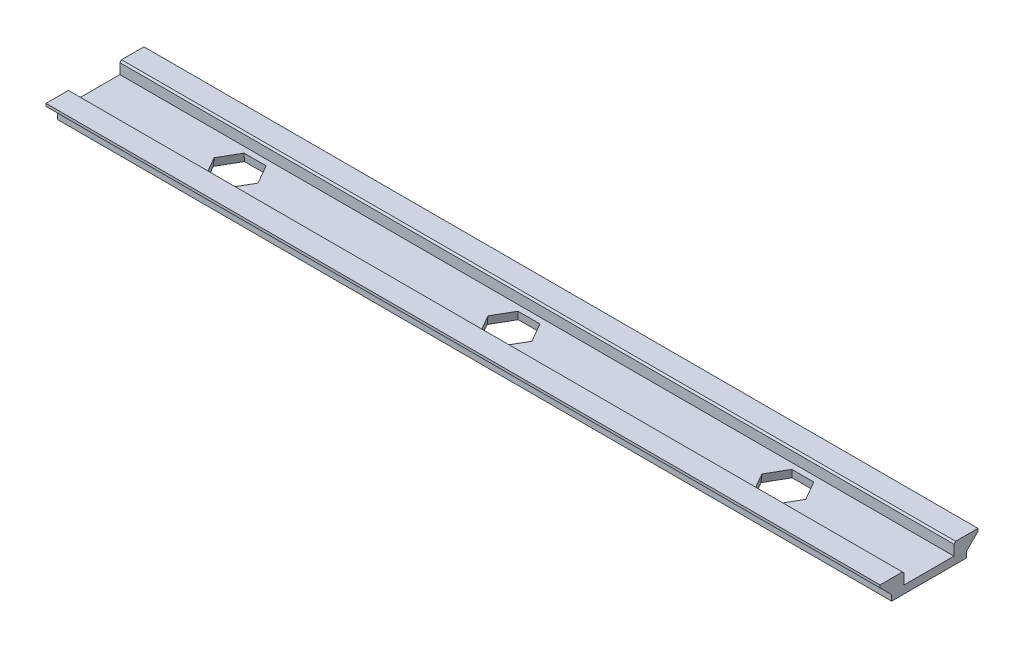
ISO-10303-21;
HEADER;
FILE_DESCRIPTION(('STEP AP214'),'2;1');
FILE_NAME('part.step','',(''),(''),'','','');
FILE_SCHEMA(('AUTOMOTIVE_DESIGN { 1 0 10303 214 1 1 1 1 }'));
ENDSEC;
DATA;
#1=APPLICATION_CONTEXT('core data for automotive mechanical design processes');
#2=APPLICATION_PROTOCOL_DEFINITION('international standard','automotive_design',2000,#1);
#3=PRODUCT_CONTEXT('',#1,'mechanical');
#4=PRODUCT('Part','Part','',(#3));
#5=PRODUCT_RELATED_PRODUCT_CATEGORY('part','',(#4));
#6=PRODUCT_DEFINITION_FORMATION('','',#4);
#7=PRODUCT_DEFINITION_CONTEXT('part definition',#1,'design');
#8=PRODUCT_DEFINITION('design','',#6,#7);
#9=PRODUCT_DEFINITION_SHAPE('','',#8);
#10=(LENGTH_UNIT() NAMED_UNIT(*) SI_UNIT(.MILLI.,.METRE.));
#11=(NAMED_UNIT(*) PLANE_ANGLE_UNIT() SI_UNIT($,.RADIAN.));
#12=(NAMED_UNIT(*) SI_UNIT($,.STERADIAN.) SOLID_ANGLE_UNIT());
#13=UNCERTAINTY_MEASURE_WITH_UNIT(LENGTH_MEASURE(1.E-05),#10,'distance_accuracy_value','');
#14=(GEOMETRIC_REPRESENTATION_CONTEXT(3) GLOBAL_UNCERTAINTY_ASSIGNED_CONTEXT((#13)) GLOBAL_UNIT_ASSIGNED_CONTEXT((#10,
#11,#12)) REPRESENTATION_CONTEXT('',''));
#15=CARTESIAN_POINT('',(0.,0.,0.));
#16=DIRECTION('',(0.,0.,1.));
#17=DIRECTION('',(1.,0.,0.));
#18=AXIS2_PLACEMENT_3D('',#15,#16,#17);
#19=CARTESIAN_POINT('',(50.25,4.59230484541326,5.1));
#20=DIRECTION('',(0.,-1.,0.));
#21=DIRECTION('',(0.,0.,-1.));
#22=AXIS2_PLACEMENT_3D('',#19,#20,#21);
#23=PLANE('',#22);
#24=DIRECTION('',(0.,0.,1.));
#25=VECTOR('',#24,1.);
#26=CARTESIAN_POINT('',(50.25,4.59230484541326,5.1));
#27=LINE('',#26,#25);
#28=CARTESIAN_POINT('',(50.25,4.59230484541326,3.19999999999999));
#29=VERTEX_POINT('',#28);
#30=CARTESIAN_POINT('',(50.25,4.59230484541326,5.9));
#31=VERTEX_POINT('',#30);
#32=EDGE_CURVE('E356',#29,#31,#27,.T.);
#33=ORIENTED_EDGE('',*,*,#32,.F.);
#34=DIRECTION('',(-1.,0.,0.));
#35=VECTOR('',#34,1.);
#36=CARTESIAN_POINT('',(50.25,4.59230484541326,3.19999999999999));
#37=LINE('',#36,#35);
#38=CARTESIAN_POINT('',(-50.25,4.59230484541326,3.19999999999999));
#39=VERTEX_POINT('',#38);
#40=EDGE_CURVE('E487',#29,#39,#37,.T.);
#41=ORIENTED_EDGE('',*,*,#40,.T.);
#42=DIRECTION('',(0.,0.,1.));
#43=VECTOR('',#42,1.);
#44=CARTESIAN_POINT('',(-50.25,4.59230484541326,5.1));
#45=LINE('',#44,#43);
#46=CARTESIAN_POINT('',(-50.25,4.59230484541326,5.9));
#47=VERTEX_POINT('',#46);
#48=EDGE_CURVE('E257',#39,#47,#45,.T.);
#49=ORIENTED_EDGE('',*,*,#48,.T.);
#50=DIRECTION('',(-1.,0.,0.));
#51=VECTOR('',#50,1.);
#52=CARTESIAN_POINT('',(50.25,4.59230484541326,5.9));
#53=LINE('',#52,#51);
#54=EDGE_CURVE('E433',#31,#47,#53,.T.);
#55=ORIENTED_EDGE('',*,*,#54,.F.);
#56=EDGE_LOOP('',(#33,#41,#49,#55));
#57=FACE_BOUND('',#56,.T.);
#58=ADVANCED_FACE('F35',(#57),#23,.F.);
#59=CARTESIAN_POINT('',(50.25,4.59230484541326,5.9));
#60=DIRECTION('',(0.,0.,-1.));
#61=DIRECTION('',(-1.,0.,0.));
#62=AXIS2_PLACEMENT_3D('',#59,#60,#61);
#63=PLANE('',#62);
#64=DIRECTION('',(0.,-1.,0.));
#65=VECTOR('',#64,1.);
#66=CARTESIAN_POINT('',(-50.25,4.59230484541326,5.9));
#67=LINE('',#66,#65);
#68=CARTESIAN_POINT('',(-50.25,4.27514755788788,5.9));
#69=VERTEX_POINT('',#68);
#70=EDGE_CURVE('E384',#47,#69,#67,.T.);
#71=ORIENTED_EDGE('',*,*,#70,.T.);
#72=DIRECTION('',(-1.,0.,0.));
#73=VECTOR('',#72,1.);
#74=CARTESIAN_POINT('',(50.25,4.27514755788788,5.9));
#75=LINE('',#74,#73);
#76=CARTESIAN_POINT('',(50.25,4.27514755788788,5.9));
#77=VERTEX_POINT('',#76);
#78=EDGE_CURVE('E430',#77,#69,#75,.T.);
#79=ORIENTED_EDGE('',*,*,#78,.F.);
#80=DIRECTION('',(0.,-1.,0.));
#81=VECTOR('',#80,1.);
#82=CARTESIAN_POINT('',(50.25,4.59230484541326,5.9));
#83=LINE('',#82,#81);
#84=EDGE_CURVE('E358',#31,#77,#83,.T.);
#85=ORIENTED_EDGE('',*,*,#84,.F.);
#86=ORIENTED_EDGE('',*,*,#54,.T.);
#87=EDGE_LOOP('',(#71,#79,#85,#86));
#88=FACE_BOUND('',#87,.T.);
#89=ADVANCED_FACE('F531',(#88),#63,.F.);
#90=CARTESIAN_POINT('',(50.25,4.27514755788788,5.9));
#91=DIRECTION('',(0.,0.707106781186549,-0.707106781186546));
#92=DIRECTION('',(0.,0.707106781186546,0.707106781186549));
#93=AXIS2_PLACEMENT_3D('',#90,#91,#92);
#94=PLANE('',#93);
#95=DIRECTION('',(0.,-0.707106781186546,-0.707106781186549));
#96=VECTOR('',#95,1.);
#97=CARTESIAN_POINT('',(-50.25,4.27514755788788,5.9));
#98=LINE('',#97,#96);
#99=CARTESIAN_POINT('',(-50.25,2.87514755788788,4.49999999999999));
#100=VERTEX_POINT('',#99);
#101=EDGE_CURVE('E386',#69,#100,#98,.T.);
#102=ORIENTED_EDGE('',*,*,#101,.T.);
#103=DIRECTION('',(-1.,0.,0.));
#104=VECTOR('',#103,1.);
#105=CARTESIAN_POINT('',(50.25,2.87514755788788,4.49999999999999));
#106=LINE('',#105,#104);
#107=CARTESIAN_POINT('',(50.25,2.87514755788788,4.49999999999999));
#108=VERTEX_POINT('',#107);
#109=EDGE_CURVE('E427',#108,#100,#106,.T.);
#110=ORIENTED_EDGE('',*,*,#109,.F.);
#111=DIRECTION('',(0.,-0.707106781186546,-0.707106781186549));
#112=VECTOR('',#111,1.);
#113=CARTESIAN_POINT('',(50.25,4.27514755788788,5.9));
#114=LINE('',#113,#112);
#115=EDGE_CURVE('E361',#77,#108,#114,.T.);
#116=ORIENTED_EDGE('',*,*,#115,.F.);
#117=ORIENTED_EDGE('',*,*,#78,.T.);
#118=EDGE_LOOP('',(#102,#110,#116,#117));
#119=FACE_BOUND('',#118,.T.);
#120=ADVANCED_FACE('F535',(#119),#94,.F.);
#121=CARTESIAN_POINT('',(50.25,2.87514755788788,4.49999999999999));
#122=DIRECTION('',(0.,0.,-1.));
#123=DIRECTION('',(-1.,0.,0.));
#124=AXIS2_PLACEMENT_3D('',#121,#122,#123);
#125=PLANE('',#124);
#126=DIRECTION('',(0.,-1.,0.));
#127=VECTOR('',#126,1.);
#128=CARTESIAN_POINT('',(-50.25,2.87514755788788,4.49999999999999));
#129=LINE('',#128,#127);
#130=CARTESIAN_POINT('',(-50.25,2.19230484541326,4.49999999999999));
#131=VERTEX_POINT('',#130);
#132=EDGE_CURVE('E388',#100,#131,#129,.T.);
#133=ORIENTED_EDGE('',*,*,#132,.T.);
#134=DIRECTION('',(-1.,0.,0.));
#135=VECTOR('',#134,1.);
#136=CARTESIAN_POINT('',(50.25,2.19230484541326,4.49999999999999));
#137=LINE('',#136,#135);
#138=CARTESIAN_POINT('',(50.25,2.19230484541326,4.49999999999999));
#139=VERTEX_POINT('',#138);
#140=EDGE_CURVE('E424',#139,#131,#137,.T.);
#141=ORIENTED_EDGE('',*,*,#140,.F.);
#142=DIRECTION('',(0.,-1.,0.));
#143=VECTOR('',#142,1.);
#144=CARTESIAN_POINT('',(50.25,2.87514755788788,4.49999999999999));
#145=LINE('',#144,#143);
#146=EDGE_CURVE('E363',#108,#139,#145,.T.);
#147=ORIENTED_EDGE('',*,*,#146,.F.);
#148=ORIENTED_EDGE('',*,*,#109,.T.);
#149=EDGE_LOOP('',(#133,#141,#147,#148));
#150=FACE_BOUND('',#149,.T.);
#151=ADVANCED_FACE('F542',(#150),#125,.F.);
#152=CARTESIAN_POINT('',(50.25,2.19230484541326,4.49999999999999));
#153=DIRECTION('',(0.,1.,0.));
#154=DIRECTION('',(0.,0.,1.));
#155=AXIS2_PLACEMENT_3D('',#152,#153,#154);
#156=PLANE('',#155);
#157=DIRECTION('',(1.,0.,0.));
#158=VECTOR('',#157,1.);
#159=CARTESIAN_POINT('',(0.,2.19230484541326,2.37503630192332));
#160=LINE('',#159,#158);
#161=CARTESIAN_POINT('',(31.3787721517494,2.19230484541326,2.37503630192331));
#162=VERTEX_POINT('',#161);
#163=CARTESIAN_POINT('',(34.1212278482506,2.19230484541326,2.37503630192331));
#164=VERTEX_POINT('',#163);
#165=EDGE_CURVE('E250',#162,#164,#160,.T.);
#166=ORIENTED_EDGE('',*,*,#165,.T.);
#167=DIRECTION('',(0.500000000000002,0.,-0.866025403784438));
#168=VECTOR('',#167,1.);
#169=CARTESIAN_POINT('',(26.6193417723758,2.19230484541326,15.3686841379319));
#170=LINE('',#169,#168);
#171=CARTESIAN_POINT('',(35.4924556965011,2.19230484541326,0.));
#172=VERTEX_POINT('',#171);
#173=EDGE_CURVE('E261',#164,#172,#170,.T.);
#174=ORIENTED_EDGE('',*,*,#173,.T.);
#175=DIRECTION('',(-0.500000000000001,0.,-0.866025403784438));
#176=VECTOR('',#175,1.);
#177=CARTESIAN_POINT('',(26.6193417723758,2.19230484541326,-15.3686841379319));
#178=LINE('',#177,#176);
#179=CARTESIAN_POINT('',(34.1212278482506,2.19230484541326,-2.37503630192331));
#180=VERTEX_POINT('',#179);
#181=EDGE_CURVE('E267',#172,#180,#178,.T.);
#182=ORIENTED_EDGE('',*,*,#181,.T.);
#183=DIRECTION('',(-1.,0.,0.));
#184=VECTOR('',#183,1.);
#185=CARTESIAN_POINT('',(0.,2.19230484541326,-2.3750363019233));
#186=LINE('',#185,#184);
#187=CARTESIAN_POINT('',(31.3787721517494,2.19230484541326,-2.37503630192331));
#188=VERTEX_POINT('',#187);
#189=EDGE_CURVE('E283',#180,#188,#186,.T.);
#190=ORIENTED_EDGE('',*,*,#189,.T.);
#191=DIRECTION('',(-0.5,0.,0.866025403784439));
#192=VECTOR('',#191,1.);
#193=CARTESIAN_POINT('',(22.5056582276242,2.19230484541326,12.9936478360085));
#194=LINE('',#193,#192);
#195=CARTESIAN_POINT('',(30.0075443034989,2.19230484541326,0.));
#196=VERTEX_POINT('',#195);
#197=EDGE_CURVE('E278',#188,#196,#194,.T.);
#198=ORIENTED_EDGE('',*,*,#197,.T.);
#199=DIRECTION('',(0.5,0.,0.866025403784439));
#200=VECTOR('',#199,1.);
#201=CARTESIAN_POINT('',(22.5056582276242,2.19230484541326,-12.9936478360085));
#202=LINE('',#201,#200);
#203=EDGE_CURVE('E274',#196,#162,#202,.T.);
#204=ORIENTED_EDGE('',*,*,#203,.T.);
#205=EDGE_LOOP('',(#166,#174,#182,#190,#198,#204));
#206=FACE_BOUND('',#205,.T.);
#207=DIRECTION('',(1.,0.,0.));
#208=VECTOR('',#207,1.);
#209=CARTESIAN_POINT('',(0.,2.19230484541326,2.37503630192354));
#210=LINE('',#209,#208);
#211=CARTESIAN_POINT('',(-1.62122784825056,2.19230484541326,2.37503630192354));
#212=VERTEX_POINT('',#211);
#213=CARTESIAN_POINT('',(1.12122784825056,2.19230484541326,2.37503630192354));
#214=VERTEX_POINT('',#213);
#215=EDGE_CURVE('E293',#212,#214,#210,.T.);
#216=ORIENTED_EDGE('',*,*,#215,.T.);
#217=DIRECTION('',(0.500000000000002,0.,-0.866025403784438));
#218=VECTOR('',#217,1.);
#219=CARTESIAN_POINT('',(1.86934177237594,2.19230484541326,1.07926497548866));
#220=LINE('',#219,#218);
#221=CARTESIAN_POINT('',(2.49245569650112,2.19230484541326,2.36030449715472E-13));
#222=VERTEX_POINT('',#221);
#223=EDGE_CURVE('E304',#214,#222,#220,.T.);
#224=ORIENTED_EDGE('',*,*,#223,.T.);
#225=DIRECTION('',(-0.500000000000001,0.,-0.866025403784438));
#226=VECTOR('',#225,1.);
#227=CARTESIAN_POINT('',(1.86934177237574,2.19230484541326,-1.07926497548854));
#228=LINE('',#227,#226);
#229=CARTESIAN_POINT('',(1.12122784825056,2.19230484541326,-2.37503630192307));
#230=VERTEX_POINT('',#229);
#231=EDGE_CURVE('E307',#222,#230,#228,.T.);
#232=ORIENTED_EDGE('',*,*,#231,.T.);
#233=DIRECTION('',(-1.,0.,0.));
#234=VECTOR('',#233,1.);
#235=CARTESIAN_POINT('',(0.,2.19230484541326,-2.37503630192308));
#236=LINE('',#235,#234);
#237=CARTESIAN_POINT('',(-1.62122784825055,2.19230484541326,-2.37503630192308));
#238=VERTEX_POINT('',#237);
#239=EDGE_CURVE('E317',#230,#238,#236,.T.);
#240=ORIENTED_EDGE('',*,*,#239,.T.);
#241=DIRECTION('',(-0.5,0.,0.866025403784439));
#242=VECTOR('',#241,1.);
#243=CARTESIAN_POINT('',(-2.24434177237573,2.19230484541326,-1.29577132643465));
#244=LINE('',#243,#242);
#245=CARTESIAN_POINT('',(-2.99245569650111,2.19230484541326,2.39704417029874E-13));
#246=VERTEX_POINT('',#245);
#247=EDGE_CURVE('E314',#238,#246,#244,.T.);
#248=ORIENTED_EDGE('',*,*,#247,.T.);
#249=DIRECTION('',(0.5,0.,0.866025403784439));
#250=VECTOR('',#249,1.);
#251=CARTESIAN_POINT('',(-2.24434177237594,2.19230484541326,1.29577132643477));
#252=LINE('',#251,#250);
#253=EDGE_CURVE('E311',#246,#212,#252,.T.);
#254=ORIENTED_EDGE('',*,*,#253,.T.);
#255=EDGE_LOOP('',(#216,#224,#232,#240,#248,#254));
#256=FACE_BOUND('',#255,.T.);
#257=DIRECTION('',(1.,0.,0.));
#258=VECTOR('',#257,1.);
#259=CARTESIAN_POINT('',(0.,2.19230484541326,2.37503630192377));
#260=LINE('',#259,#258);
#261=CARTESIAN_POINT('',(-34.6212278482506,2.19230484541326,2.37503630192377));
#262=VERTEX_POINT('',#261);
#263=CARTESIAN_POINT('',(-31.8787721517494,2.19230484541326,2.37503630192377));
#264=VERTEX_POINT('',#263);
#265=EDGE_CURVE('E328',#262,#264,#260,.T.);
#266=ORIENTED_EDGE('',*,*,#265,.T.);
#267=DIRECTION('',(0.500000000000002,0.,-0.866025403784438));
#268=VECTOR('',#267,1.);
#269=CARTESIAN_POINT('',(-22.8806582276239,2.19230484541326,-13.2101541869545));
#270=LINE('',#269,#268);
#271=CARTESIAN_POINT('',(-30.5075443034989,2.19230484541326,4.66425240595042E-13));
#272=VERTEX_POINT('',#271);
#273=EDGE_CURVE('E339',#264,#272,#270,.T.);
#274=ORIENTED_EDGE('',*,*,#273,.T.);
#275=DIRECTION('',(-0.500000000000001,0.,-0.866025403784438));
#276=VECTOR('',#275,1.);
#277=CARTESIAN_POINT('',(-22.8806582276243,2.19230484541326,13.2101541869548));
#278=LINE('',#277,#276);
#279=CARTESIAN_POINT('',(-31.8787721517494,2.19230484541326,-2.37503630192284));
#280=VERTEX_POINT('',#279);
#281=EDGE_CURVE('E342',#272,#280,#278,.T.);
#282=ORIENTED_EDGE('',*,*,#281,.T.);
#283=DIRECTION('',(-1.,0.,0.));
#284=VECTOR('',#283,1.);
#285=CARTESIAN_POINT('',(0.,2.19230484541326,-2.37503630192285));
#286=LINE('',#285,#284);
#287=CARTESIAN_POINT('',(-34.6212278482506,2.19230484541326,-2.37503630192285));
#288=VERTEX_POINT('',#287);
#289=EDGE_CURVE('E351',#280,#288,#286,.T.);
#290=ORIENTED_EDGE('',*,*,#289,.T.);
#291=DIRECTION('',(-0.5,0.,0.866025403784439));
#292=VECTOR('',#291,1.);
#293=CARTESIAN_POINT('',(-26.9943417723756,2.19230484541326,-15.5851904888778));
#294=LINE('',#293,#292);
#295=CARTESIAN_POINT('',(-35.9924556965011,2.19230484541326,4.70251019758386E-13));
#296=VERTEX_POINT('',#295);
#297=EDGE_CURVE('E348',#288,#296,#294,.T.);
#298=ORIENTED_EDGE('',*,*,#297,.T.);
#299=DIRECTION('',(0.5,0.,0.866025403784439));
#300=VECTOR('',#299,1.);
#301=CARTESIAN_POINT('',(-26.994341772376,2.19230484541326,15.5851904888781));
#302=LINE('',#301,#300);
#303=EDGE_CURVE('E345',#296,#262,#302,.T.);
#304=ORIENTED_EDGE('',*,*,#303,.T.);
#305=EDGE_LOOP('',(#266,#274,#282,#290,#298,#304));
#306=FACE_BOUND('',#305,.T.);
#307=DIRECTION('',(0.,0.,-1.));
#308=VECTOR('',#307,1.);
#309=CARTESIAN_POINT('',(-50.25,2.19230484541326,4.49999999999999));
#310=LINE('',#309,#308);
#311=CARTESIAN_POINT('',(-50.25,2.19230484541326,-4.49999999999999));
#312=VERTEX_POINT('',#311);
#313=EDGE_CURVE('E390',#131,#312,#310,.T.);
#314=ORIENTED_EDGE('',*,*,#313,.T.);
#315=DIRECTION('',(-1.,0.,0.));
#316=VECTOR('',#315,1.);
#317=CARTESIAN_POINT('',(50.25,2.19230484541326,-4.49999999999999));
#318=LINE('',#317,#316);
#319=CARTESIAN_POINT('',(50.25,2.19230484541326,-4.49999999999999));
#320=VERTEX_POINT('',#319);
#321=EDGE_CURVE('E421',#320,#312,#318,.T.);
#322=ORIENTED_EDGE('',*,*,#321,.F.);
#323=DIRECTION('',(0.,0.,-1.));
#324=VECTOR('',#323,1.);
#325=CARTESIAN_POINT('',(50.25,2.19230484541326,4.49999999999999));
#326=LINE('',#325,#324);
#327=EDGE_CURVE('E365',#139,#320,#326,.T.);
#328=ORIENTED_EDGE('',*,*,#327,.F.);
#329=ORIENTED_EDGE('',*,*,#140,.T.);
#330=EDGE_LOOP('',(#314,#322,#328,#329));
#331=FACE_BOUND('',#330,.T.);
#332=ADVANCED_FACE('F270',(#206,#256,#306,#331),#156,.F.);
#333=CARTESIAN_POINT('',(50.25,2.87514755788788,-4.49999999999999));
#334=DIRECTION('',(0.,0.,1.));
#335=DIRECTION('',(0.,-1.,0.));
#336=AXIS2_PLACEMENT_3D('',#333,#334,#335);
#337=PLANE('',#336);
#338=DIRECTION('',(0.,1.,0.));
#339=VECTOR('',#338,1.);
#340=CARTESIAN_POINT('',(-50.25,2.87514755788788,-4.49999999999999));
#341=LINE('',#340,#339);
#342=CARTESIAN_POINT('',(-50.25,2.87514755788788,-4.49999999999999));
#343=VERTEX_POINT('',#342);
#344=EDGE_CURVE('E392',#312,#343,#341,.T.);
#345=ORIENTED_EDGE('',*,*,#344,.T.);
#346=DIRECTION('',(-1.,0.,0.));
#347=VECTOR('',#346,1.);
#348=CARTESIAN_POINT('',(50.25,2.87514755788788,-4.49999999999999));
#349=LINE('',#348,#347);
#350=CARTESIAN_POINT('',(50.25,2.87514755788788,-4.49999999999999));
#351=VERTEX_POINT('',#350);
#352=EDGE_CURVE('E418',#351,#343,#349,.T.);
#353=ORIENTED_EDGE('',*,*,#352,.F.);
#354=DIRECTION('',(0.,1.,0.));
#355=VECTOR('',#354,1.);
#356=CARTESIAN_POINT('',(50.25,2.87514755788788,-4.49999999999999));
#357=LINE('',#356,#355);
#358=EDGE_CURVE('E367',#320,#351,#357,.T.);
#359=ORIENTED_EDGE('',*,*,#358,.F.);
#360=ORIENTED_EDGE('',*,*,#321,.T.);
#361=EDGE_LOOP('',(#345,#353,#359,#360));
#362=FACE_BOUND('',#361,.T.);
#363=ADVANCED_FACE('F549',(#362),#337,.F.);
#364=CARTESIAN_POINT('',(50.25,4.27514755788788,-5.9));
#365=DIRECTION('',(0.,0.707106781186549,0.707106781186546));
#366=DIRECTION('',(0.,-0.707106781186546,0.707106781186549));
#367=AXIS2_PLACEMENT_3D('',#364,#365,#366);
#368=PLANE('',#367);
#369=DIRECTION('',(0.,0.707106781186546,-0.707106781186549));
#370=VECTOR('',#369,1.);
#371=CARTESIAN_POINT('',(-50.25,4.27514755788788,-5.9));
#372=LINE('',#371,#370);
#373=CARTESIAN_POINT('',(-50.25,4.27514755788788,-5.9));
#374=VERTEX_POINT('',#373);
#375=EDGE_CURVE('E394',#343,#374,#372,.T.);
#376=ORIENTED_EDGE('',*,*,#375,.T.);
#377=DIRECTION('',(-1.,0.,0.));
#378=VECTOR('',#377,1.);
#379=CARTESIAN_POINT('',(50.25,4.27514755788788,-5.9));
#380=LINE('',#379,#378);
#381=CARTESIAN_POINT('',(50.25,4.27514755788788,-5.9));
#382=VERTEX_POINT('',#381);
#383=EDGE_CURVE('E415',#382,#374,#380,.T.);
#384=ORIENTED_EDGE('',*,*,#383,.F.);
#385=DIRECTION('',(0.,0.707106781186546,-0.707106781186549));
#386=VECTOR('',#385,1.);
#387=CARTESIAN_POINT('',(50.25,4.27514755788788,-5.9));
#388=LINE('',#387,#386);
#389=EDGE_CURVE('E369',#351,#382,#388,.T.);
#390=ORIENTED_EDGE('',*,*,#389,.F.);
#391=ORIENTED_EDGE('',*,*,#352,.T.);
#392=EDGE_LOOP('',(#376,#384,#390,#391));
#393=FACE_BOUND('',#392,.T.);
#394=ADVANCED_FACE('F555',(#393),#368,.F.);
#395=CARTESIAN_POINT('',(50.25,4.59230484541326,-5.9));
#396=DIRECTION('',(0.,0.,1.));
#397=DIRECTION('',(1.,0.,0.));
#398=AXIS2_PLACEMENT_3D('',#395,#396,#397);
#399=PLANE('',#398);
#400=DIRECTION('',(0.,1.,0.));
#401=VECTOR('',#400,1.);
#402=CARTESIAN_POINT('',(-50.25,4.59230484541326,-5.9));
#403=LINE('',#402,#401);
#404=CARTESIAN_POINT('',(-50.25,4.59230484541326,-5.9));
#405=VERTEX_POINT('',#404);
#406=EDGE_CURVE('E396',#374,#405,#403,.T.);
#407=ORIENTED_EDGE('',*,*,#406,.T.);
#408=DIRECTION('',(-1.,0.,0.));
#409=VECTOR('',#408,1.);
#410=CARTESIAN_POINT('',(50.25,4.59230484541326,-5.9));
#411=LINE('',#410,#409);
#412=CARTESIAN_POINT('',(50.25,4.59230484541326,-5.9));
#413=VERTEX_POINT('',#412);
#414=EDGE_CURVE('E412',#413,#405,#411,.T.);
#415=ORIENTED_EDGE('',*,*,#414,.F.);
#416=DIRECTION('',(0.,1.,0.));
#417=VECTOR('',#416,1.);
#418=CARTESIAN_POINT('',(50.25,4.59230484541326,-5.9));
#419=LINE('',#418,#417);
#420=EDGE_CURVE('E371',#382,#413,#419,.T.);
#421=ORIENTED_EDGE('',*,*,#420,.F.);
#422=ORIENTED_EDGE('',*,*,#383,.T.);
#423=EDGE_LOOP('',(#407,#415,#421,#422));
#424=FACE_BOUND('',#423,.T.);
#425=ADVANCED_FACE('F559',(#424),#399,.F.);
#426=CARTESIAN_POINT('',(50.25,4.59230484541326,-5.1));
#427=DIRECTION('',(0.,-1.,0.));
#428=DIRECTION('',(0.,0.,-1.));
#429=AXIS2_PLACEMENT_3D('',#426,#427,#428);
#430=PLANE('',#429);
#431=DIRECTION('',(0.,0.,1.));
#432=VECTOR('',#431,1.);
#433=CARTESIAN_POINT('',(-50.25,4.59230484541326,-5.1));
#434=LINE('',#433,#432);
#435=CARTESIAN_POINT('',(-50.25,4.59230484541326,-3.19999999999999));
#436=VERTEX_POINT('',#435);
#437=EDGE_CURVE('E399',#405,#436,#434,.T.);
#438=ORIENTED_EDGE('',*,*,#437,.T.);
#439=DIRECTION('',(1.,0.,0.));
#440=VECTOR('',#439,1.);
#441=CARTESIAN_POINT('',(50.25,4.59230484541326,-3.19999999999999));
#442=LINE('',#441,#440);
#443=CARTESIAN_POINT('',(50.25,4.59230484541327,-3.19999999999999));
#444=VERTEX_POINT('',#443);
#445=EDGE_CURVE('E11',#436,#444,#442,.T.);
#446=ORIENTED_EDGE('',*,*,#445,.T.);
#447=DIRECTION('',(0.,0.,1.));
#448=VECTOR('',#447,1.);
#449=CARTESIAN_POINT('',(50.25,4.59230484541326,-5.1));
#450=LINE('',#449,#448);
#451=EDGE_CURVE('E373',#413,#444,#450,.T.);
#452=ORIENTED_EDGE('',*,*,#451,.F.);
#453=ORIENTED_EDGE('',*,*,#414,.T.);
#454=EDGE_LOOP('',(#438,#446,#452,#453));
#455=FACE_BOUND('',#454,.T.);
#456=ADVANCED_FACE('F560',(#455),#430,.F.);
#457=CARTESIAN_POINT('',(50.25,4.59230484541326,-3.));
#458=DIRECTION('',(0.,0.,-1.));
#459=DIRECTION('',(-1.,0.,0.));
#460=AXIS2_PLACEMENT_3D('',#457,#458,#459);
#461=PLANE('',#460);
#462=DIRECTION('',(0.,-1.,0.));
#463=VECTOR('',#462,1.);
#464=CARTESIAN_POINT('',(50.25,4.59230484541326,-3.));
#465=LINE('',#464,#463);
#466=CARTESIAN_POINT('',(50.25,4.39230484541327,-3.));
#467=VERTEX_POINT('',#466);
#468=CARTESIAN_POINT('',(50.25,3.14230484541326,-3.));
#469=VERTEX_POINT('',#468);
#470=EDGE_CURVE('E375',#467,#469,#465,.T.);
#471=ORIENTED_EDGE('',*,*,#470,.F.);
#472=DIRECTION('',(-1.,0.,0.));
#473=VECTOR('',#472,1.);
#474=CARTESIAN_POINT('',(50.25,4.39230484541327,-3.));
#475=LINE('',#474,#473);
#476=CARTESIAN_POINT('',(-50.25,4.39230484541327,-3.));
#477=VERTEX_POINT('',#476);
#478=EDGE_CURVE('E44',#467,#477,#475,.T.);
#479=ORIENTED_EDGE('',*,*,#478,.T.);
#480=DIRECTION('',(0.,-1.,0.));
#481=VECTOR('',#480,1.);
#482=CARTESIAN_POINT('',(-50.25,4.59230484541326,-3.));
#483=LINE('',#482,#481);
#484=CARTESIAN_POINT('',(-50.25,3.14230484541326,-3.));
#485=VERTEX_POINT('',#484);
#486=EDGE_CURVE('E401',#477,#485,#483,.T.);
#487=ORIENTED_EDGE('',*,*,#486,.T.);
#488=DIRECTION('',(-1.,0.,0.));
#489=VECTOR('',#488,1.);
#490=CARTESIAN_POINT('',(50.25,3.14230484541326,-3.));
#491=LINE('',#490,#489);
#492=EDGE_CURVE('E409',#469,#485,#491,.T.);
#493=ORIENTED_EDGE('',*,*,#492,.F.);
#494=EDGE_LOOP('',(#471,#479,#487,#493));
#495=FACE_BOUND('',#494,.T.);
#496=ADVANCED_FACE('F502',(#495),#461,.F.);
#497=CARTESIAN_POINT('',(50.25,3.14230484541326,3.));
#498=DIRECTION('',(0.,-1.,0.));
#499=DIRECTION('',(0.,0.,-1.));
#500=AXIS2_PLACEMENT_3D('',#497,#498,#499);
#501=PLANE('',#500);
#502=DIRECTION('',(0.500000000000001,0.,0.866025403784438));
#503=VECTOR('',#502,1.);
#504=CARTESIAN_POINT('',(40.4089008431537,3.14230484541326,8.681761247327));
#505=LINE('',#504,#503);
#506=CARTESIAN_POINT('',(34.0732418249847,3.14230484541326,-2.29192207157368));
#507=VERTEX_POINT('',#506);
#508=CARTESIAN_POINT('',(35.3964836499694,3.14230484541326,0.));
#509=VERTEX_POINT('',#508);
#510=EDGE_CURVE('E472',#507,#509,#505,.T.);
#511=ORIENTED_EDGE('',*,*,#510,.T.);
#512=DIRECTION('',(-0.500000000000002,0.,0.866025403784438));
#513=VECTOR('',#512,1.);
#514=CARTESIAN_POINT('',(37.8108246318004,3.14230484541326,-4.18176124732701));
#515=LINE('',#514,#513);
#516=CARTESIAN_POINT('',(34.0732418249847,3.14230484541326,2.29192207157368));
#517=VERTEX_POINT('',#516);
#518=EDGE_CURVE('E485',#509,#517,#515,.T.);
#519=ORIENTED_EDGE('',*,*,#518,.T.);
#520=DIRECTION('',(-1.,0.,0.));
#521=VECTOR('',#520,1.);
#522=CARTESIAN_POINT('',(50.25,3.14230484541326,2.29192207157368));
#523=LINE('',#522,#521);
#524=CARTESIAN_POINT('',(31.4267581750153,3.14230484541326,2.29192207157368));
#525=VERTEX_POINT('',#524);
#526=EDGE_CURVE('E253',#517,#525,#523,.T.);
#527=ORIENTED_EDGE('',*,*,#526,.T.);
#528=DIRECTION('',(-0.5,0.,-0.866025403784439));
#529=VECTOR('',#528,1.);
#530=CARTESIAN_POINT('',(36.4391753681996,3.14230484541326,10.9736833189007));
#531=LINE('',#530,#529);
#532=CARTESIAN_POINT('',(30.1035163500306,3.14230484541326,0.));
#533=VERTEX_POINT('',#532);
#534=EDGE_CURVE('E481',#525,#533,#531,.T.);
#535=ORIENTED_EDGE('',*,*,#534,.T.);
#536=DIRECTION('',(0.5,0.,-0.866025403784439));
#537=VECTOR('',#536,1.);
#538=CARTESIAN_POINT('',(33.8410991568463,3.14230484541326,-6.47368331890068));
#539=LINE('',#538,#537);
#540=CARTESIAN_POINT('',(31.4267581750153,3.14230484541326,-2.29192207157368));
#541=VERTEX_POINT('',#540);
#542=EDGE_CURVE('E478',#533,#541,#539,.T.);
#543=ORIENTED_EDGE('',*,*,#542,.T.);
#544=DIRECTION('',(1.,0.,0.));
#545=VECTOR('',#544,1.);
#546=CARTESIAN_POINT('',(50.25,3.14230484541326,-2.29192207157368));
#547=LINE('',#546,#545);
#548=EDGE_CURVE('E475',#541,#507,#547,.T.);
#549=ORIENTED_EDGE('',*,*,#548,.T.);
#550=EDGE_LOOP('',(#511,#519,#527,#535,#543,#549));
#551=FACE_BOUND('',#550,.T.);
#552=DIRECTION('',(0.500000000000001,0.,0.866025403784438));
#553=VECTOR('',#552,1.);
#554=CARTESIAN_POINT('',(15.6589008431537,3.14230484541326,22.9711804097703));
#555=LINE('',#554,#553);
#556=CARTESIAN_POINT('',(1.07324182498472,3.14230484541326,-2.29192207157345));
#557=VERTEX_POINT('',#556);
#558=CARTESIAN_POINT('',(2.39648364996943,3.14230484541326,2.39391839684799E-13));
#559=VERTEX_POINT('',#558);
#560=EDGE_CURVE('E454',#557,#559,#555,.T.);
#561=ORIENTED_EDGE('',*,*,#560,.T.);
#562=DIRECTION('',(-0.500000000000002,0.,0.866025403784438));
#563=VECTOR('',#562,1.);
#564=CARTESIAN_POINT('',(13.0608246318006,3.14230484541326,-18.4711804097702));
#565=LINE('',#564,#563);
#566=CARTESIAN_POINT('',(1.07324182498471,3.14230484541326,2.29192207157392));
#567=VERTEX_POINT('',#566);
#568=EDGE_CURVE('E469',#559,#567,#565,.T.);
#569=ORIENTED_EDGE('',*,*,#568,.T.);
#570=DIRECTION('',(-1.,0.,0.));
#571=VECTOR('',#570,1.);
#572=CARTESIAN_POINT('',(50.25,3.14230484541326,2.29192207157391));
#573=LINE('',#572,#571);
#574=CARTESIAN_POINT('',(-1.57324182498472,3.14230484541326,2.29192207157392));
#575=VERTEX_POINT('',#574);
#576=EDGE_CURVE('E466',#567,#575,#573,.T.);
#577=ORIENTED_EDGE('',*,*,#576,.T.);
#578=DIRECTION('',(-0.5,0.,-0.866025403784439));
#579=VECTOR('',#578,1.);
#580=CARTESIAN_POINT('',(11.6891753681995,3.14230484541326,25.263102481344));
#581=LINE('',#580,#579);
#582=CARTESIAN_POINT('',(-2.89648364996942,3.14230484541326,2.39608680119296E-13));
#583=VERTEX_POINT('',#582);
#584=EDGE_CURVE('E463',#575,#583,#581,.T.);
#585=ORIENTED_EDGE('',*,*,#584,.T.);
#586=DIRECTION('',(0.5,0.,-0.866025403784439));
#587=VECTOR('',#586,1.);
#588=CARTESIAN_POINT('',(9.09109915684638,3.14230484541326,-20.7631024813439));
#589=LINE('',#588,#587);
#590=CARTESIAN_POINT('',(-1.57324182498471,3.14230484541326,-2.29192207157345));
#591=VERTEX_POINT('',#590);
#592=EDGE_CURVE('E460',#583,#591,#589,.T.);
#593=ORIENTED_EDGE('',*,*,#592,.T.);
#594=DIRECTION('',(1.,0.,0.));
#595=VECTOR('',#594,1.);
#596=CARTESIAN_POINT('',(50.25,3.14230484541326,-2.29192207157346));
#597=LINE('',#596,#595);
#598=EDGE_CURVE('E457',#591,#557,#597,.T.);
#599=ORIENTED_EDGE('',*,*,#598,.T.);
#600=EDGE_LOOP('',(#561,#569,#577,#585,#593,#599));
#601=FACE_BOUND('',#600,.T.);
#602=DIRECTION('',(0.500000000000001,0.,0.866025403784438));
#603=VECTOR('',#602,1.);
#604=CARTESIAN_POINT('',(-9.09109915684643,3.14230484541326,37.2605995722136));
#605=LINE('',#604,#603);
#606=CARTESIAN_POINT('',(-31.9267581750153,3.14230484541326,-2.29192207157321));
#607=VERTEX_POINT('',#606);
#608=CARTESIAN_POINT('',(-30.6035163500306,3.14230484541326,4.64905891561784E-13));
#609=VERTEX_POINT('',#608);
#610=EDGE_CURVE('E436',#607,#609,#605,.T.);
#611=ORIENTED_EDGE('',*,*,#610,.T.);
#612=DIRECTION('',(-0.500000000000002,0.,0.866025403784438));
#613=VECTOR('',#612,1.);
#614=CARTESIAN_POINT('',(-11.6891753681993,3.14230484541326,-32.7605995722134));
#615=LINE('',#614,#613);
#616=CARTESIAN_POINT('',(-31.9267581750153,3.14230484541326,2.29192207157415));
#617=VERTEX_POINT('',#616);
#618=EDGE_CURVE('E451',#609,#617,#615,.T.);
#619=ORIENTED_EDGE('',*,*,#618,.T.);
#620=DIRECTION('',(-1.,0.,0.));
#621=VECTOR('',#620,1.);
#622=CARTESIAN_POINT('',(50.25,3.14230484541326,2.29192207157413));
#623=LINE('',#622,#621);
#624=CARTESIAN_POINT('',(-34.5732418249847,3.14230484541326,2.29192207157414));
#625=VERTEX_POINT('',#624);
#626=EDGE_CURVE('E448',#617,#625,#623,.T.);
#627=ORIENTED_EDGE('',*,*,#626,.T.);
#628=DIRECTION('',(-0.5,0.,-0.866025403784439));
#629=VECTOR('',#628,1.);
#630=CARTESIAN_POINT('',(-13.0608246318006,3.14230484541326,39.5525216437873));
#631=LINE('',#630,#629);
#632=CARTESIAN_POINT('',(-35.8964836499694,3.14230484541326,4.7791631763161E-13));
#633=VERTEX_POINT('',#632);
#634=EDGE_CURVE('E445',#625,#633,#631,.T.);
#635=ORIENTED_EDGE('',*,*,#634,.T.);
#636=DIRECTION('',(0.5,0.,-0.866025403784439));
#637=VECTOR('',#636,1.);
#638=CARTESIAN_POINT('',(-15.6589008431535,3.14230484541326,-35.052521643787));
#639=LINE('',#638,#637);
#640=CARTESIAN_POINT('',(-34.5732418249847,3.14230484541326,-2.29192207157322));
#641=VERTEX_POINT('',#640);
#642=EDGE_CURVE('E442',#633,#641,#639,.T.);
#643=ORIENTED_EDGE('',*,*,#642,.T.);
#644=DIRECTION('',(1.,0.,0.));
#645=VECTOR('',#644,1.);
#646=CARTESIAN_POINT('',(50.25,3.14230484541326,-2.29192207157323));
#647=LINE('',#646,#645);
#648=EDGE_CURVE('E439',#641,#607,#647,.T.);
#649=ORIENTED_EDGE('',*,*,#648,.T.);
#650=EDGE_LOOP('',(#611,#619,#627,#635,#643,#649));
#651=FACE_BOUND('',#650,.T.);
#652=DIRECTION('',(0.,0.,1.));
#653=VECTOR('',#652,1.);
#654=CARTESIAN_POINT('',(-50.25,3.14230484541326,3.));
#655=LINE('',#654,#653);
#656=CARTESIAN_POINT('',(-50.25,3.14230484541326,3.));
#657=VERTEX_POINT('',#656);
#658=EDGE_CURVE('E403',#485,#657,#655,.T.);
#659=ORIENTED_EDGE('',*,*,#658,.T.);
#660=DIRECTION('',(-1.,0.,0.));
#661=VECTOR('',#660,1.);
#662=CARTESIAN_POINT('',(50.25,3.14230484541326,3.));
#663=LINE('',#662,#661);
#664=CARTESIAN_POINT('',(50.25,3.14230484541326,3.));
#665=VERTEX_POINT('',#664);
#666=EDGE_CURVE('E382',#665,#657,#663,.T.);
#667=ORIENTED_EDGE('',*,*,#666,.F.);
#668=DIRECTION('',(0.,0.,1.));
#669=VECTOR('',#668,1.);
#670=CARTESIAN_POINT('',(50.25,3.14230484541326,3.));
#671=LINE('',#670,#669);
#672=EDGE_CURVE('E377',#469,#665,#671,.T.);
#673=ORIENTED_EDGE('',*,*,#672,.F.);
#674=ORIENTED_EDGE('',*,*,#492,.T.);
#675=EDGE_LOOP('',(#659,#667,#673,#674));
#676=FACE_BOUND('',#675,.T.);
#677=ADVANCED_FACE('F512',(#551,#601,#651,#676),#501,.F.);
#678=CARTESIAN_POINT('',(50.25,4.59230484541326,3.));
#679=DIRECTION('',(0.,0.,1.));
#680=DIRECTION('',(1.,0.,0.));
#681=AXIS2_PLACEMENT_3D('',#678,#679,#680);
#682=PLANE('',#681);
#683=DIRECTION('',(0.,1.,0.));
#684=VECTOR('',#683,1.);
#685=CARTESIAN_POINT('',(-50.25,4.59230484541326,3.));
#686=LINE('',#685,#684);
#687=CARTESIAN_POINT('',(-50.25,4.39230484541327,3.));
#688=VERTEX_POINT('',#687);
#689=EDGE_CURVE('E359',#657,#688,#686,.T.);
#690=ORIENTED_EDGE('',*,*,#689,.T.);
#691=DIRECTION('',(1.,0.,0.));
#692=VECTOR('',#691,1.);
#693=CARTESIAN_POINT('',(50.25,4.39230484541327,3.));
#694=LINE('',#693,#692);
#695=CARTESIAN_POINT('',(50.25,4.39230484541327,3.));
#696=VERTEX_POINT('',#695);
#697=EDGE_CURVE('E494',#688,#696,#694,.T.);
#698=ORIENTED_EDGE('',*,*,#697,.T.);
#699=DIRECTION('',(0.,1.,0.));
#700=VECTOR('',#699,1.);
#701=CARTESIAN_POINT('',(50.25,4.59230484541326,3.));
#702=LINE('',#701,#700);
#703=EDGE_CURVE('E379',#665,#696,#702,.T.);
#704=ORIENTED_EDGE('',*,*,#703,.F.);
#705=ORIENTED_EDGE('',*,*,#666,.T.);
#706=EDGE_LOOP('',(#690,#698,#704,#705));
#707=FACE_BOUND('',#706,.T.);
#708=ADVANCED_FACE('F516',(#707),#682,.F.);
#709=CARTESIAN_POINT('',(50.25,0.,0.));
#710=DIRECTION('',(-1.,0.,0.));
#711=DIRECTION('',(0.,0.,1.));
#712=AXIS2_PLACEMENT_3D('',#709,#710,#711);
#713=PLANE('',#712);
#714=ORIENTED_EDGE('',*,*,#703,.T.);
#715=DIRECTION('',(0.,-0.707106781186548,-0.707106781186548));
#716=VECTOR('',#715,1.);
#717=CARTESIAN_POINT('',(50.25,4.59230484541326,3.19999999999999));
#718=LINE('',#717,#716);
#719=EDGE_CURVE('E497',#696,#29,#718,.F.);
#720=ORIENTED_EDGE('',*,*,#719,.T.);
#721=ORIENTED_EDGE('',*,*,#32,.T.);
#722=ORIENTED_EDGE('',*,*,#84,.T.);
#723=ORIENTED_EDGE('',*,*,#115,.T.);
#724=ORIENTED_EDGE('',*,*,#146,.T.);
#725=ORIENTED_EDGE('',*,*,#327,.T.);
#726=ORIENTED_EDGE('',*,*,#358,.T.);
#727=ORIENTED_EDGE('',*,*,#389,.T.);
#728=ORIENTED_EDGE('',*,*,#420,.T.);
#729=ORIENTED_EDGE('',*,*,#451,.T.);
#730=DIRECTION('',(0.,0.707106781186548,-0.707106781186548));
#731=VECTOR('',#730,1.);
#732=CARTESIAN_POINT('',(50.25,4.39230484541327,-3.));
#733=LINE('',#732,#731);
#734=EDGE_CURVE('E51',#444,#467,#733,.F.);
#735=ORIENTED_EDGE('',*,*,#734,.T.);
#736=ORIENTED_EDGE('',*,*,#470,.T.);
#737=ORIENTED_EDGE('',*,*,#672,.T.);
#738=EDGE_LOOP('',(#714,#720,#721,#722,#723,#724,#725,#726,#727,#728,#729,#735,#736,#737));
#739=FACE_BOUND('',#738,.T.);
#740=ADVANCED_FACE('F519',(#739),#713,.F.);
#741=CARTESIAN_POINT('',(-50.25,0.,0.));
#742=DIRECTION('',(-1.,0.,0.));
#743=DIRECTION('',(0.,0.,1.));
#744=AXIS2_PLACEMENT_3D('',#741,#742,#743);
#745=PLANE('',#744);
#746=ORIENTED_EDGE('',*,*,#48,.F.);
#747=DIRECTION('',(0.,0.707106781186548,0.707106781186548));
#748=VECTOR('',#747,1.);
#749=CARTESIAN_POINT('',(-50.25,0.696152422706635,-0.696152422706635));
#750=LINE('',#749,#748);
#751=EDGE_CURVE('E492',#39,#688,#750,.F.);
#752=ORIENTED_EDGE('',*,*,#751,.T.);
#753=ORIENTED_EDGE('',*,*,#689,.F.);
#754=ORIENTED_EDGE('',*,*,#658,.F.);
#755=ORIENTED_EDGE('',*,*,#486,.F.);
#756=DIRECTION('',(0.,-0.707106781186548,0.707106781186548));
#757=VECTOR('',#756,1.);
#758=CARTESIAN_POINT('',(-50.25,0.696152422706633,0.696152422706633));
#759=LINE('',#758,#757);
#760=EDGE_CURVE('E490',#477,#436,#759,.F.);
#761=ORIENTED_EDGE('',*,*,#760,.T.);
#762=ORIENTED_EDGE('',*,*,#437,.F.);
#763=ORIENTED_EDGE('',*,*,#406,.F.);
#764=ORIENTED_EDGE('',*,*,#375,.F.);
#765=ORIENTED_EDGE('',*,*,#344,.F.);
#766=ORIENTED_EDGE('',*,*,#313,.F.);
#767=ORIENTED_EDGE('',*,*,#132,.F.);
#768=ORIENTED_EDGE('',*,*,#101,.F.);
#769=ORIENTED_EDGE('',*,*,#70,.F.);
#770=EDGE_LOOP('',(#746,#752,#753,#754,#755,#761,#762,#763,#764,#765,#766,#767,#768,#769));
#771=FACE_BOUND('',#770,.T.);
#772=ADVANCED_FACE('F508',(#771),#745,.T.);
#773=CARTESIAN_POINT('',(-32.,4.59230484541325,2.16506350946156));
#774=DIRECTION('',(0.86272991566282,0.0871557427476584,0.498097349045874));
#775=DIRECTION('',(0.500000000000002,0.,-0.866025403784438));
#776=AXIS2_PLACEMENT_3D('',#773,#774,#775);
#777=PLANE('',#776);
#778=DIRECTION('',(-0.100511613750393,0.994935885120892,0.));
#779=VECTOR('',#778,1.);
#780=CARTESIAN_POINT('',(-30.7626282306234,4.71730810965285,4.66640615037761E-13));
#781=LINE('',#780,#779);
#782=EDGE_CURVE('E325',#272,#609,#781,.T.);
#783=ORIENTED_EDGE('',*,*,#782,.F.);
#784=ORIENTED_EDGE('',*,*,#273,.F.);
#785=DIRECTION('',(-0.0502558068751962,0.994935885120891,-0.0870456108832092));
#786=VECTOR('',#785,1.);
#787=CARTESIAN_POINT('',(-32.0063141153117,4.71730810965285,2.15412714093686));
#788=LINE('',#787,#786);
#789=EDGE_CURVE('E308',#264,#617,#788,.T.);
#790=ORIENTED_EDGE('',*,*,#789,.T.);
#791=ORIENTED_EDGE('',*,*,#618,.F.);
#792=EDGE_LOOP('',(#783,#784,#790,#791));
#793=FACE_BOUND('',#792,.T.);
#794=ADVANCED_FACE('F601',(#793),#777,.F.);
#795=CARTESIAN_POINT('',(-34.5,4.59230484541325,2.16506350946156));
#796=DIRECTION('',(0.,0.0871557427476584,0.996194698091746));
#797=DIRECTION('',(0.,-0.996194698091746,0.0871557427476584));
#798=AXIS2_PLACEMENT_3D('',#795,#796,#797);
#799=PLANE('',#798);
#800=ORIENTED_EDGE('',*,*,#789,.F.);
#801=ORIENTED_EDGE('',*,*,#265,.F.);
#802=DIRECTION('',(0.0502558068751963,0.994935885120891,-0.0870456108832093));
#803=VECTOR('',#802,1.);
#804=CARTESIAN_POINT('',(-34.4936858846883,4.71730810965285,2.15412714093686));
#805=LINE('',#804,#803);
#806=EDGE_CURVE('E324',#262,#625,#805,.T.);
#807=ORIENTED_EDGE('',*,*,#806,.T.);
#808=ORIENTED_EDGE('',*,*,#626,.F.);
#809=EDGE_LOOP('',(#800,#801,#807,#808));
#810=FACE_BOUND('',#809,.T.);
#811=ADVANCED_FACE('F604',(#810),#799,.F.);
#812=CARTESIAN_POINT('',(-35.75,4.59230484541325,4.70099207909444E-13));
#813=DIRECTION('',(-0.862729915662821,0.0871557427476584,0.498097349045873));
#814=DIRECTION('',(0.5,0.,0.866025403784439));
#815=AXIS2_PLACEMENT_3D('',#812,#813,#814);
#816=PLANE('',#815);
#817=ORIENTED_EDGE('',*,*,#806,.F.);
#818=ORIENTED_EDGE('',*,*,#303,.F.);
#819=DIRECTION('',(0.100511613750393,0.994935885120891,0.));
#820=VECTOR('',#819,1.);
#821=CARTESIAN_POINT('',(-35.7373717693766,4.71730810965285,4.70110061989715E-13));
#822=LINE('',#821,#820);
#823=EDGE_CURVE('E334',#296,#633,#822,.T.);
#824=ORIENTED_EDGE('',*,*,#823,.T.);
#825=ORIENTED_EDGE('',*,*,#634,.F.);
#826=EDGE_LOOP('',(#817,#818,#824,#825));
#827=FACE_BOUND('',#826,.T.);
#828=ADVANCED_FACE('F607',(#827),#816,.F.);
#829=CARTESIAN_POINT('',(-34.5,4.59230484541325,-2.16506350946063));
#830=DIRECTION('',(-0.862729915662821,0.0871557427476584,-0.498097349045873));
#831=DIRECTION('',(-0.5,0.,0.866025403784439));
#832=AXIS2_PLACEMENT_3D('',#829,#830,#831);
#833=PLANE('',#832);
#834=ORIENTED_EDGE('',*,*,#823,.F.);
#835=ORIENTED_EDGE('',*,*,#297,.F.);
#836=DIRECTION('',(0.0502558068751963,0.994935885120892,0.0870456108832093));
#837=VECTOR('',#836,1.);
#838=CARTESIAN_POINT('',(-34.4936858846883,4.71730810965285,-2.15412714093593));
#839=LINE('',#838,#837);
#840=EDGE_CURVE('E331',#288,#641,#839,.T.);
#841=ORIENTED_EDGE('',*,*,#840,.T.);
#842=ORIENTED_EDGE('',*,*,#642,.F.);
#843=EDGE_LOOP('',(#834,#835,#841,#842));
#844=FACE_BOUND('',#843,.T.);
#845=ADVANCED_FACE('F611',(#844),#833,.F.);
#846=CARTESIAN_POINT('',(-32.,4.59230484541325,-2.16506350946063));
#847=DIRECTION('',(0.,0.0871557427476584,-0.996194698091746));
#848=DIRECTION('',(0.,0.996194698091746,0.0871557427476584));
#849=AXIS2_PLACEMENT_3D('',#846,#847,#848);
#850=PLANE('',#849);
#851=ORIENTED_EDGE('',*,*,#840,.F.);
#852=ORIENTED_EDGE('',*,*,#289,.F.);
#853=DIRECTION('',(-0.0502558068751962,0.994935885120892,0.0870456108832093));
#854=VECTOR('',#853,1.);
#855=CARTESIAN_POINT('',(-32.0063141153117,4.71730810965285,-2.15412714093593));
#856=LINE('',#855,#854);
#857=EDGE_CURVE('E327',#280,#607,#856,.T.);
#858=ORIENTED_EDGE('',*,*,#857,.T.);
#859=ORIENTED_EDGE('',*,*,#648,.F.);
#860=EDGE_LOOP('',(#851,#852,#858,#859));
#861=FACE_BOUND('',#860,.T.);
#862=ADVANCED_FACE('F615',(#861),#850,.F.);
#863=CARTESIAN_POINT('',(-30.75,4.59230484541325,4.66436680293397E-13));
#864=DIRECTION('',(0.862729915662821,0.0871557427476584,-0.498097349045873));
#865=DIRECTION('',(-0.500000000000001,0.,-0.866025403784438));
#866=AXIS2_PLACEMENT_3D('',#863,#864,#865);
#867=PLANE('',#866);
#868=ORIENTED_EDGE('',*,*,#857,.F.);
#869=ORIENTED_EDGE('',*,*,#281,.F.);
#870=ORIENTED_EDGE('',*,*,#782,.T.);
#871=ORIENTED_EDGE('',*,*,#610,.F.);
#872=EDGE_LOOP('',(#868,#869,#870,#871));
#873=FACE_BOUND('',#872,.T.);
#874=ADVANCED_FACE('F619',(#873),#867,.F.);
#875=CARTESIAN_POINT('',(1.,4.59230484541325,2.16506350946133));
#876=DIRECTION('',(0.86272991566282,0.0871557427476584,0.498097349045874));
#877=DIRECTION('',(0.500000000000002,0.,-0.866025403784438));
#878=AXIS2_PLACEMENT_3D('',#875,#876,#877);
#879=PLANE('',#878);
#880=DIRECTION('',(-0.100511613750393,0.994935885120892,0.));
#881=VECTOR('',#880,1.);
#882=CARTESIAN_POINT('',(2.23737176937662,4.71730810965285,2.35922392732846E-13));
#883=LINE('',#882,#881);
#884=EDGE_CURVE('E290',#222,#559,#883,.T.);
#885=ORIENTED_EDGE('',*,*,#884,.F.);
#886=ORIENTED_EDGE('',*,*,#223,.F.);
#887=DIRECTION('',(-0.0502558068751962,0.994935885120891,-0.0870456108832092));
#888=VECTOR('',#887,1.);
#889=CARTESIAN_POINT('',(0.993685884688309,4.71730810965285,2.15412714093663));
#890=LINE('',#889,#888);
#891=EDGE_CURVE('E268',#214,#567,#890,.T.);
#892=ORIENTED_EDGE('',*,*,#891,.T.);
#893=ORIENTED_EDGE('',*,*,#568,.F.);
#894=EDGE_LOOP('',(#885,#886,#892,#893));
#895=FACE_BOUND('',#894,.T.);
#896=ADVANCED_FACE('F623',(#895),#879,.F.);
#897=CARTESIAN_POINT('',(-1.5,4.59230484541325,2.16506350946133));
#898=DIRECTION('',(0.,0.0871557427476584,0.996194698091746));
#899=DIRECTION('',(0.,-0.996194698091746,0.0871557427476584));
#900=AXIS2_PLACEMENT_3D('',#897,#898,#899);
#901=PLANE('',#900);
#902=ORIENTED_EDGE('',*,*,#891,.F.);
#903=ORIENTED_EDGE('',*,*,#215,.F.);
#904=DIRECTION('',(0.0502558068751962,0.994935885120891,-0.0870456108832093));
#905=VECTOR('',#904,1.);
#906=CARTESIAN_POINT('',(-1.49368588468831,4.71730810965285,2.15412714093663));
#907=LINE('',#906,#905);
#908=EDGE_CURVE('E289',#212,#575,#907,.T.);
#909=ORIENTED_EDGE('',*,*,#908,.T.);
#910=ORIENTED_EDGE('',*,*,#576,.F.);
#911=EDGE_LOOP('',(#902,#903,#909,#910));
#912=FACE_BOUND('',#911,.T.);
#913=ADVANCED_FACE('F628',(#912),#901,.F.);
#914=CARTESIAN_POINT('',(-2.75,4.59230484541325,2.39661439545797E-13));
#915=DIRECTION('',(-0.862729915662821,0.0871557427476584,0.498097349045873));
#916=DIRECTION('',(0.5,0.,0.866025403784439));
#917=AXIS2_PLACEMENT_3D('',#914,#915,#916);
#918=PLANE('',#917);
#919=ORIENTED_EDGE('',*,*,#908,.F.);
#920=ORIENTED_EDGE('',*,*,#253,.F.);
#921=DIRECTION('',(0.100511613750393,0.994935885120891,0.));
#922=VECTOR('',#921,1.);
#923=CARTESIAN_POINT('',(-2.73737176937661,4.71730810965285,2.39825520553794E-13));
#924=LINE('',#923,#922);
#925=EDGE_CURVE('E299',#246,#583,#924,.T.);
#926=ORIENTED_EDGE('',*,*,#925,.T.);
#927=ORIENTED_EDGE('',*,*,#584,.F.);
#928=EDGE_LOOP('',(#919,#920,#926,#927));
#929=FACE_BOUND('',#928,.T.);
#930=ADVANCED_FACE('F631',(#929),#918,.F.);
#931=CARTESIAN_POINT('',(-1.49999999999999,4.59230484541325,-2.16506350946086));
#932=DIRECTION('',(-0.862729915662821,0.0871557427476584,-0.498097349045873));
#933=DIRECTION('',(-0.5,0.,0.866025403784439));
#934=AXIS2_PLACEMENT_3D('',#931,#932,#933);
#935=PLANE('',#934);
#936=ORIENTED_EDGE('',*,*,#925,.F.);
#937=ORIENTED_EDGE('',*,*,#247,.F.);
#938=DIRECTION('',(0.0502558068751963,0.994935885120892,0.0870456108832093));
#939=VECTOR('',#938,1.);
#940=CARTESIAN_POINT('',(-1.4936858846883,4.71730810965285,-2.15412714093616));
#941=LINE('',#940,#939);
#942=EDGE_CURVE('E296',#238,#591,#941,.T.);
#943=ORIENTED_EDGE('',*,*,#942,.T.);
#944=ORIENTED_EDGE('',*,*,#592,.F.);
#945=EDGE_LOOP('',(#936,#937,#943,#944));
#946=FACE_BOUND('',#945,.T.);
#947=ADVANCED_FACE('F635',(#946),#935,.F.);
#948=CARTESIAN_POINT('',(1.,4.59230484541325,-2.16506350946086));
#949=DIRECTION('',(0.,0.0871557427476584,-0.996194698091746));
#950=DIRECTION('',(0.,0.996194698091746,0.0871557427476584));
#951=AXIS2_PLACEMENT_3D('',#948,#949,#950);
#952=PLANE('',#951);
#953=ORIENTED_EDGE('',*,*,#942,.F.);
#954=ORIENTED_EDGE('',*,*,#239,.F.);
#955=DIRECTION('',(-0.0502558068751962,0.994935885120892,0.0870456108832093));
#956=VECTOR('',#955,1.);
#957=CARTESIAN_POINT('',(0.993685884688308,4.71730810965285,-2.15412714093616));
#958=LINE('',#957,#956);
#959=EDGE_CURVE('E292',#230,#557,#958,.T.);
#960=ORIENTED_EDGE('',*,*,#959,.T.);
#961=ORIENTED_EDGE('',*,*,#598,.F.);
#962=EDGE_LOOP('',(#953,#954,#960,#961));
#963=FACE_BOUND('',#962,.T.);
#964=ADVANCED_FACE('F639',(#963),#952,.F.);
#965=CARTESIAN_POINT('',(2.25,4.59230484541325,2.3599891192975E-13));
#966=DIRECTION('',(0.862729915662821,0.0871557427476584,-0.498097349045873));
#967=DIRECTION('',(-0.500000000000001,0.,-0.866025403784438));
#968=AXIS2_PLACEMENT_3D('',#965,#966,#967);
#969=PLANE('',#968);
#970=ORIENTED_EDGE('',*,*,#959,.F.);
#971=ORIENTED_EDGE('',*,*,#231,.F.);
#972=ORIENTED_EDGE('',*,*,#884,.T.);
#973=ORIENTED_EDGE('',*,*,#560,.F.);
#974=EDGE_LOOP('',(#970,#971,#972,#973));
#975=FACE_BOUND('',#974,.T.);
#976=ADVANCED_FACE('F643',(#975),#969,.F.);
#977=CARTESIAN_POINT('',(34.,4.59230484541325,2.1650635094611));
#978=DIRECTION('',(0.86272991566282,0.0871557427476584,0.498097349045874));
#979=DIRECTION('',(0.500000000000002,0.,-0.866025403784438));
#980=AXIS2_PLACEMENT_3D('',#977,#978,#979);
#981=PLANE('',#980);
#982=DIRECTION('',(-0.100511613750393,0.994935885120892,0.));
#983=VECTOR('',#982,1.);
#984=CARTESIAN_POINT('',(35.2373717693766,4.71730810965285,0.));
#985=LINE('',#984,#983);
#986=EDGE_CURVE('E263',#172,#509,#985,.T.);
#987=ORIENTED_EDGE('',*,*,#986,.F.);
#988=ORIENTED_EDGE('',*,*,#173,.F.);
#989=DIRECTION('',(-0.0502558068751962,0.994935885120891,-0.0870456108832092));
#990=VECTOR('',#989,1.);
#991=CARTESIAN_POINT('',(33.9936858846883,4.71730810965285,2.1541271409364));
#992=LINE('',#991,#990);
#993=EDGE_CURVE('E245',#164,#517,#992,.T.);
#994=ORIENTED_EDGE('',*,*,#993,.T.);
#995=ORIENTED_EDGE('',*,*,#518,.F.);
#996=EDGE_LOOP('',(#987,#988,#994,#995));
#997=FACE_BOUND('',#996,.T.);
#998=ADVANCED_FACE('F262',(#997),#981,.F.);
#999=CARTESIAN_POINT('',(31.5,4.59230484541325,2.1650635094611));
#1000=DIRECTION('',(0.,0.0871557427476584,0.996194698091746));
#1001=DIRECTION('',(0.,-0.996194698091746,0.0871557427476584));
#1002=AXIS2_PLACEMENT_3D('',#999,#1000,#1001);
#1003=PLANE('',#1002);
#1004=ORIENTED_EDGE('',*,*,#993,.F.);
#1005=ORIENTED_EDGE('',*,*,#165,.F.);
#1006=DIRECTION('',(0.0502558068751963,0.994935885120891,-0.0870456108832093));
#1007=VECTOR('',#1006,1.);
#1008=CARTESIAN_POINT('',(31.5063141153117,4.71730810965285,2.1541271409364));
#1009=LINE('',#1008,#1007);
#1010=EDGE_CURVE('E258',#162,#525,#1009,.T.);
#1011=ORIENTED_EDGE('',*,*,#1010,.T.);
#1012=ORIENTED_EDGE('',*,*,#526,.F.);
#1013=EDGE_LOOP('',(#1004,#1005,#1011,#1012));
#1014=FACE_BOUND('',#1013,.T.);
#1015=ADVANCED_FACE('F247',(#1014),#1003,.F.);
#1016=CARTESIAN_POINT('',(30.25,4.59230484541325,0.));
#1017=DIRECTION('',(-0.862729915662821,0.0871557427476584,0.498097349045873));
#1018=DIRECTION('',(0.5,0.,0.866025403784439));
#1019=AXIS2_PLACEMENT_3D('',#1016,#1017,#1018);
#1020=PLANE('',#1019);
#1021=ORIENTED_EDGE('',*,*,#1010,.F.);
#1022=ORIENTED_EDGE('',*,*,#203,.F.);
#1023=DIRECTION('',(0.100511613750393,0.994935885120891,0.));
#1024=VECTOR('',#1023,1.);
#1025=CARTESIAN_POINT('',(30.2626282306234,4.71730810965285,0.));
#1026=LINE('',#1025,#1024);
#1027=EDGE_CURVE('E881',#196,#533,#1026,.T.);
#1028=ORIENTED_EDGE('',*,*,#1027,.T.);
#1029=ORIENTED_EDGE('',*,*,#534,.F.);
#1030=EDGE_LOOP('',(#1021,#1022,#1028,#1029));
#1031=FACE_BOUND('',#1030,.T.);
#1032=ADVANCED_FACE('F653',(#1031),#1020,.F.);
#1033=CARTESIAN_POINT('',(31.5,4.59230484541325,-2.16506350946109));
#1034=DIRECTION('',(-0.862729915662821,0.0871557427476584,-0.498097349045873));
#1035=DIRECTION('',(-0.5,0.,0.866025403784439));
#1036=AXIS2_PLACEMENT_3D('',#1033,#1034,#1035);
#1037=PLANE('',#1036);
#1038=ORIENTED_EDGE('',*,*,#1027,.F.);
#1039=ORIENTED_EDGE('',*,*,#197,.F.);
#1040=DIRECTION('',(0.0502558068751963,0.994935885120892,0.0870456108832093));
#1041=VECTOR('',#1040,1.);
#1042=CARTESIAN_POINT('',(31.5063141153117,4.71730810965285,-2.15412714093639));
#1043=LINE('',#1042,#1041);
#1044=EDGE_CURVE('E877',#188,#541,#1043,.T.);
#1045=ORIENTED_EDGE('',*,*,#1044,.T.);
#1046=ORIENTED_EDGE('',*,*,#542,.F.);
#1047=EDGE_LOOP('',(#1038,#1039,#1045,#1046));
#1048=FACE_BOUND('',#1047,.T.);
#1049=ADVANCED_FACE('F656',(#1048),#1037,.F.);
#1050=CARTESIAN_POINT('',(34.,4.59230484541325,-2.16506350946109));
#1051=DIRECTION('',(0.,0.0871557427476584,-0.996194698091746));
#1052=DIRECTION('',(0.,0.996194698091746,0.0871557427476584));
#1053=AXIS2_PLACEMENT_3D('',#1050,#1051,#1052);
#1054=PLANE('',#1053);
#1055=ORIENTED_EDGE('',*,*,#1044,.F.);
#1056=ORIENTED_EDGE('',*,*,#189,.F.);
#1057=DIRECTION('',(-0.0502558068751962,0.994935885120892,0.0870456108832093));
#1058=VECTOR('',#1057,1.);
#1059=CARTESIAN_POINT('',(33.9936858846883,4.71730810965285,-2.15412714093639));
#1060=LINE('',#1059,#1058);
#1061=EDGE_CURVE('E276',#180,#507,#1060,.T.);
#1062=ORIENTED_EDGE('',*,*,#1061,.T.);
#1063=ORIENTED_EDGE('',*,*,#548,.F.);
#1064=EDGE_LOOP('',(#1055,#1056,#1062,#1063));
#1065=FACE_BOUND('',#1064,.T.);
#1066=ADVANCED_FACE('F660',(#1065),#1054,.F.);
#1067=CARTESIAN_POINT('',(35.25,4.59230484541325,0.));
#1068=DIRECTION('',(0.862729915662821,0.0871557427476584,-0.498097349045873));
#1069=DIRECTION('',(-0.500000000000001,0.,-0.866025403784438));
#1070=AXIS2_PLACEMENT_3D('',#1067,#1068,#1069);
#1071=PLANE('',#1070);
#1072=ORIENTED_EDGE('',*,*,#1061,.F.);
#1073=ORIENTED_EDGE('',*,*,#181,.F.);
#1074=ORIENTED_EDGE('',*,*,#986,.T.);
#1075=ORIENTED_EDGE('',*,*,#510,.F.);
#1076=EDGE_LOOP('',(#1072,#1073,#1074,#1075));
#1077=FACE_BOUND('',#1076,.T.);
#1078=ADVANCED_FACE('F565',(#1077),#1071,.F.);
#1079=CARTESIAN_POINT('',(50.25,4.59230484541326,3.19999999999999));
#1080=DIRECTION('',(0.,-0.707106781186548,0.707106781186548));
#1081=DIRECTION('',(-1.,0.,0.));
#1082=AXIS2_PLACEMENT_3D('',#1079,#1080,#1081);
#1083=PLANE('',#1082);
#1084=ORIENTED_EDGE('',*,*,#719,.F.);
#1085=ORIENTED_EDGE('',*,*,#697,.F.);
#1086=ORIENTED_EDGE('',*,*,#751,.F.);
#1087=ORIENTED_EDGE('',*,*,#40,.F.);
#1088=EDGE_LOOP('',(#1084,#1085,#1086,#1087));
#1089=FACE_BOUND('',#1088,.T.);
#1090=ADVANCED_FACE('F523',(#1089),#1083,.F.);
#1091=CARTESIAN_POINT('',(50.25,4.39230484541327,-3.));
#1092=DIRECTION('',(0.,-0.707106781186548,-0.707106781186548));
#1093=DIRECTION('',(-1.,0.,0.));
#1094=AXIS2_PLACEMENT_3D('',#1091,#1092,#1093);
#1095=PLANE('',#1094);
#1096=ORIENTED_EDGE('',*,*,#734,.F.);
#1097=ORIENTED_EDGE('',*,*,#445,.F.);
#1098=ORIENTED_EDGE('',*,*,#760,.F.);
#1099=ORIENTED_EDGE('',*,*,#478,.F.);
#1100=EDGE_LOOP('',(#1096,#1097,#1098,#1099));
#1101=FACE_BOUND('',#1100,.T.);
#1102=ADVANCED_FACE('F38',(#1101),#1095,.F.);
#1103=CLOSED_SHELL('',(#58,#89,#120,#151,#332,#363,#394,#425,#456,#496,#677,#708,#740,#772,#794,
#811,#828,#845,#862,#874,#896,#913,#930,#947,#964,#976,#998,#1015,#1032,#1049,#1066,#1078,#1090,#1102));
#1104=MANIFOLD_SOLID_BREP('B2',#1103);
#1105=ADVANCED_BREP_SHAPE_REPRESENTATION('',(#18,#1104),#14);
#1106=SHAPE_DEFINITION_REPRESENTATION(#9,#1105);
ENDSEC;
END-ISO-10303-21;
